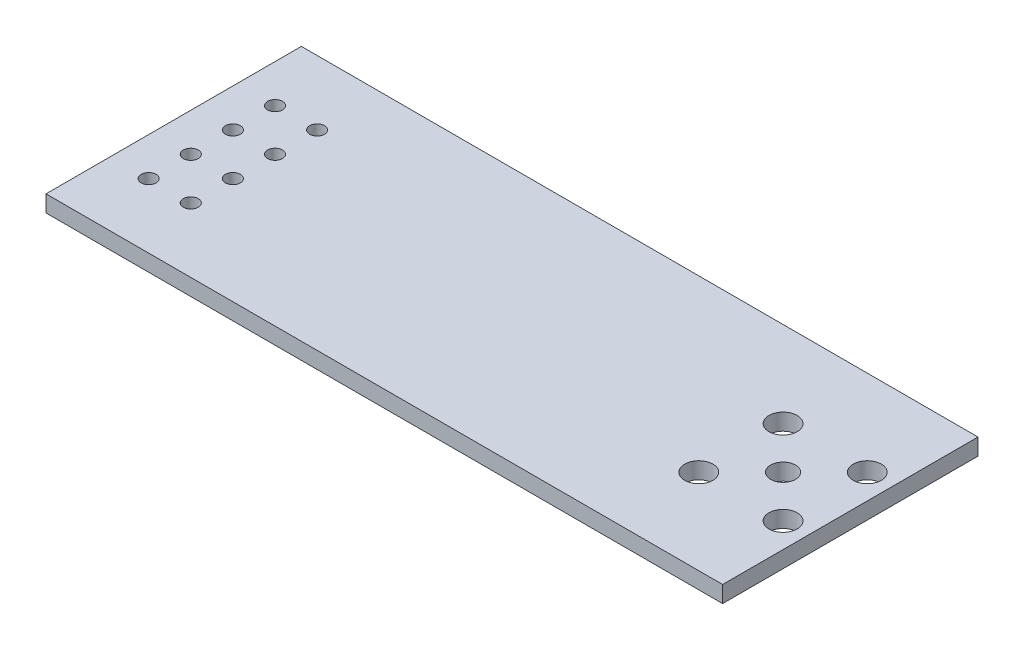
ISO-10303-21;
HEADER;
FILE_DESCRIPTION(('STEP AP214'),'2;1');
FILE_NAME('part.step','',(''),(''),'','','');
FILE_SCHEMA(('AUTOMOTIVE_DESIGN { 1 0 10303 214 1 1 1 1 }'));
ENDSEC;
DATA;
#1=APPLICATION_CONTEXT('core data for automotive mechanical design processes');
#2=APPLICATION_PROTOCOL_DEFINITION('international standard','automotive_design',2000,#1);
#3=PRODUCT_CONTEXT('',#1,'mechanical');
#4=PRODUCT('Part','Part','',(#3));
#5=PRODUCT_RELATED_PRODUCT_CATEGORY('part','',(#4));
#6=PRODUCT_DEFINITION_FORMATION('','',#4);
#7=PRODUCT_DEFINITION_CONTEXT('part definition',#1,'design');
#8=PRODUCT_DEFINITION('design','',#6,#7);
#9=PRODUCT_DEFINITION_SHAPE('','',#8);
#10=(LENGTH_UNIT() NAMED_UNIT(*) SI_UNIT(.MILLI.,.METRE.));
#11=(NAMED_UNIT(*) PLANE_ANGLE_UNIT() SI_UNIT($,.RADIAN.));
#12=(NAMED_UNIT(*) SI_UNIT($,.STERADIAN.) SOLID_ANGLE_UNIT());
#13=UNCERTAINTY_MEASURE_WITH_UNIT(LENGTH_MEASURE(1.E-05),#10,'distance_accuracy_value','');
#14=(GEOMETRIC_REPRESENTATION_CONTEXT(3) GLOBAL_UNCERTAINTY_ASSIGNED_CONTEXT((#13)) GLOBAL_UNIT_ASSIGNED_CONTEXT((#10,
#11,#12)) REPRESENTATION_CONTEXT('',''));
#15=CARTESIAN_POINT('',(0.,0.,0.));
#16=DIRECTION('',(0.,0.,1.));
#17=DIRECTION('',(1.,0.,0.));
#18=AXIS2_PLACEMENT_3D('',#15,#16,#17);
#19=CARTESIAN_POINT('',(0.,1.,0.));
#20=DIRECTION('',(0.,-1.,0.));
#21=DIRECTION('',(0.,0.,-1.));
#22=AXIS2_PLACEMENT_3D('',#19,#20,#21);
#23=PLANE('',#22);
#24=DIRECTION('',(0.,0.,1.));
#25=VECTOR('',#24,1.);
#26=CARTESIAN_POINT('',(0.,1.,0.));
#27=LINE('',#26,#25);
#28=CARTESIAN_POINT('',(0.,1.,-15.4));
#29=VERTEX_POINT('',#28);
#30=CARTESIAN_POINT('',(0.,1.,0.));
#31=VERTEX_POINT('',#30);
#32=EDGE_CURVE('E90',#29,#31,#27,.T.);
#33=ORIENTED_EDGE('',*,*,#32,.T.);
#34=DIRECTION('',(1.,0.,0.));
#35=VECTOR('',#34,1.);
#36=CARTESIAN_POINT('',(0.,1.,0.));
#37=LINE('',#36,#35);
#38=CARTESIAN_POINT('',(40.8,1.,0.));
#39=VERTEX_POINT('',#38);
#40=EDGE_CURVE('E85',#31,#39,#37,.T.);
#41=ORIENTED_EDGE('',*,*,#40,.T.);
#42=DIRECTION('',(0.,0.,-1.));
#43=VECTOR('',#42,1.);
#44=CARTESIAN_POINT('',(40.8,1.,0.));
#45=LINE('',#44,#43);
#46=CARTESIAN_POINT('',(40.8,1.,-15.4));
#47=VERTEX_POINT('',#46);
#48=EDGE_CURVE('E88',#39,#47,#45,.T.);
#49=ORIENTED_EDGE('',*,*,#48,.T.);
#50=DIRECTION('',(-1.,0.,0.));
#51=VECTOR('',#50,1.);
#52=CARTESIAN_POINT('',(0.,1.,-15.4));
#53=LINE('',#52,#51);
#54=EDGE_CURVE('E55',#47,#29,#53,.T.);
#55=ORIENTED_EDGE('',*,*,#54,.T.);
#56=EDGE_LOOP('',(#33,#41,#49,#55));
#57=FACE_BOUND('',#56,.T.);
#58=CARTESIAN_POINT('',(2.29999234116474,1.,-3.89));
#59=DIRECTION('',(0.,1.,0.));
#60=DIRECTION('',(0.,0.,1.));
#61=AXIS2_PLACEMENT_3D('',#58,#59,#60);
#62=CIRCLE('',#61,0.45);
#63=CARTESIAN_POINT('',(2.29999234116474,1.,-3.44));
#64=VERTEX_POINT('',#63);
#65=EDGE_CURVE('E105',#64,#64,#62,.T.);
#66=ORIENTED_EDGE('',*,*,#65,.F.);
#67=EDGE_LOOP('',(#66));
#68=FACE_BOUND('',#67,.T.);
#69=CARTESIAN_POINT('',(2.29999392821584,1.,-6.43000000000198));
#70=DIRECTION('',(0.,1.,0.));
#71=DIRECTION('',(0.,0.,1.));
#72=AXIS2_PLACEMENT_3D('',#69,#70,#71);
#73=CIRCLE('',#72,0.45);
#74=CARTESIAN_POINT('',(2.29999392821584,1.,-5.98000000000198));
#75=VERTEX_POINT('',#74);
#76=EDGE_CURVE('E120',#75,#75,#73,.T.);
#77=ORIENTED_EDGE('',*,*,#76,.F.);
#78=EDGE_LOOP('',(#77));
#79=FACE_BOUND('',#78,.T.);
#80=CARTESIAN_POINT('',(2.29999551526694,1.,-8.97000000000396));
#81=DIRECTION('',(0.,1.,0.));
#82=DIRECTION('',(0.,0.,1.));
#83=AXIS2_PLACEMENT_3D('',#80,#81,#82);
#84=CIRCLE('',#83,0.449999999998743);
#85=CARTESIAN_POINT('',(2.29999551526694,1.,-8.52000000000521));
#86=VERTEX_POINT('',#85);
#87=EDGE_CURVE('E126',#86,#86,#84,.T.);
#88=ORIENTED_EDGE('',*,*,#87,.F.);
#89=EDGE_LOOP('',(#88));
#90=FACE_BOUND('',#89,.T.);
#91=CARTESIAN_POINT('',(2.3,1.,-11.51));
#92=DIRECTION('',(0.,1.,0.));
#93=DIRECTION('',(0.,0.,1.));
#94=AXIS2_PLACEMENT_3D('',#91,#92,#93);
#95=CIRCLE('',#94,0.45);
#96=CARTESIAN_POINT('',(2.3,1.,-11.06));
#97=VERTEX_POINT('',#96);
#98=EDGE_CURVE('E132',#97,#97,#95,.T.);
#99=ORIENTED_EDGE('',*,*,#98,.F.);
#100=EDGE_LOOP('',(#99));
#101=FACE_BOUND('',#100,.T.);
#102=CARTESIAN_POINT('',(4.83999234116474,1.,-3.89));
#103=DIRECTION('',(0.,1.,0.));
#104=DIRECTION('',(0.,0.,1.));
#105=AXIS2_PLACEMENT_3D('',#102,#103,#104);
#106=CIRCLE('',#105,0.45);
#107=CARTESIAN_POINT('',(4.83999234116474,1.,-3.44));
#108=VERTEX_POINT('',#107);
#109=EDGE_CURVE('E138',#108,#108,#106,.T.);
#110=ORIENTED_EDGE('',*,*,#109,.F.);
#111=EDGE_LOOP('',(#110));
#112=FACE_BOUND('',#111,.T.);
#113=CARTESIAN_POINT('',(4.83999234116474,1.,-6.43));
#114=DIRECTION('',(0.,1.,0.));
#115=DIRECTION('',(0.,0.,1.));
#116=AXIS2_PLACEMENT_3D('',#113,#114,#115);
#117=CIRCLE('',#116,0.45);
#118=CARTESIAN_POINT('',(4.83999234116474,1.,-5.98));
#119=VERTEX_POINT('',#118);
#120=EDGE_CURVE('E144',#119,#119,#117,.T.);
#121=ORIENTED_EDGE('',*,*,#120,.F.);
#122=EDGE_LOOP('',(#121));
#123=FACE_BOUND('',#122,.T.);
#124=CARTESIAN_POINT('',(4.83999234116474,1.,-8.97));
#125=DIRECTION('',(0.,1.,0.));
#126=DIRECTION('',(0.,0.,1.));
#127=AXIS2_PLACEMENT_3D('',#124,#125,#126);
#128=CIRCLE('',#127,0.450000000000002);
#129=CARTESIAN_POINT('',(4.83999234116474,1.,-8.52));
#130=VERTEX_POINT('',#129);
#131=EDGE_CURVE('E150',#130,#130,#128,.T.);
#132=ORIENTED_EDGE('',*,*,#131,.F.);
#133=EDGE_LOOP('',(#132));
#134=FACE_BOUND('',#133,.T.);
#135=CARTESIAN_POINT('',(4.83999234116474,1.,-11.51));
#136=DIRECTION('',(0.,1.,0.));
#137=DIRECTION('',(0.,0.,1.));
#138=AXIS2_PLACEMENT_3D('',#135,#136,#137);
#139=CIRCLE('',#138,0.450000000000002);
#140=CARTESIAN_POINT('',(4.83999234116474,1.,-11.06));
#141=VERTEX_POINT('',#140);
#142=EDGE_CURVE('E156',#141,#141,#139,.T.);
#143=ORIENTED_EDGE('',*,*,#142,.F.);
#144=EDGE_LOOP('',(#143));
#145=FACE_BOUND('',#144,.T.);
#146=CARTESIAN_POINT('',(34.22,1.,-10.2243668977098));
#147=DIRECTION('',(0.,1.,0.));
#148=DIRECTION('',(0.,0.,1.));
#149=AXIS2_PLACEMENT_3D('',#146,#147,#148);
#150=CIRCLE('',#149,0.849999999999999);
#151=CARTESIAN_POINT('',(34.22,1.,-9.37436689770982));
#152=VERTEX_POINT('',#151);
#153=EDGE_CURVE('E162',#152,#152,#150,.T.);
#154=ORIENTED_EDGE('',*,*,#153,.F.);
#155=EDGE_LOOP('',(#154));
#156=FACE_BOUND('',#155,.T.);
#157=CARTESIAN_POINT('',(34.22,1.,-5.14436689770982));
#158=DIRECTION('',(0.,1.,0.));
#159=DIRECTION('',(0.,0.,1.));
#160=AXIS2_PLACEMENT_3D('',#157,#158,#159);
#161=CIRCLE('',#160,0.85);
#162=CARTESIAN_POINT('',(34.22,1.,-4.29436689770982));
#163=VERTEX_POINT('',#162);
#164=EDGE_CURVE('E168',#163,#163,#161,.T.);
#165=ORIENTED_EDGE('',*,*,#164,.F.);
#166=EDGE_LOOP('',(#165));
#167=FACE_BOUND('',#166,.T.);
#168=CARTESIAN_POINT('',(39.3,1.,-5.14436689770982));
#169=DIRECTION('',(0.,1.,0.));
#170=DIRECTION('',(0.,0.,1.));
#171=AXIS2_PLACEMENT_3D('',#168,#169,#170);
#172=CIRCLE('',#171,0.85);
#173=CARTESIAN_POINT('',(39.3,1.,-4.29436689770982));
#174=VERTEX_POINT('',#173);
#175=EDGE_CURVE('E174',#174,#174,#172,.T.);
#176=ORIENTED_EDGE('',*,*,#175,.F.);
#177=EDGE_LOOP('',(#176));
#178=FACE_BOUND('',#177,.T.);
#179=CARTESIAN_POINT('',(39.3,1.,-10.2243668977098));
#180=DIRECTION('',(0.,1.,0.));
#181=DIRECTION('',(0.,0.,1.));
#182=AXIS2_PLACEMENT_3D('',#179,#180,#181);
#183=CIRCLE('',#182,0.849999999999999);
#184=CARTESIAN_POINT('',(39.3,1.,-9.37436689770982));
#185=VERTEX_POINT('',#184);
#186=EDGE_CURVE('E180',#185,#185,#183,.T.);
#187=ORIENTED_EDGE('',*,*,#186,.F.);
#188=EDGE_LOOP('',(#187));
#189=FACE_BOUND('',#188,.T.);
#190=CARTESIAN_POINT('',(36.76,1.,-7.68436689770982));
#191=DIRECTION('',(0.,1.,0.));
#192=DIRECTION('',(0.,0.,1.));
#193=AXIS2_PLACEMENT_3D('',#190,#191,#192);
#194=CIRCLE('',#193,0.749999999999999);
#195=CARTESIAN_POINT('',(36.76,1.,-6.93436689770982));
#196=VERTEX_POINT('',#195);
#197=EDGE_CURVE('E186',#196,#196,#194,.T.);
#198=ORIENTED_EDGE('',*,*,#197,.F.);
#199=EDGE_LOOP('',(#198));
#200=FACE_BOUND('',#199,.T.);
#201=ADVANCED_FACE('F38',(#57,#68,#79,#90,#101,#112,#123,#134,#145,#156,#167,#178,#189,#200),
#23,.F.);
#202=CARTESIAN_POINT('',(0.,0.,0.));
#203=DIRECTION('',(0.,-1.,0.));
#204=DIRECTION('',(0.,0.,-1.));
#205=AXIS2_PLACEMENT_3D('',#202,#203,#204);
#206=PLANE('',#205);
#207=CARTESIAN_POINT('',(39.3,0.,-10.2243668977098));
#208=DIRECTION('',(0.,1.,0.));
#209=DIRECTION('',(0.,0.,1.));
#210=AXIS2_PLACEMENT_3D('',#207,#208,#209);
#211=CIRCLE('',#210,0.849999999999999);
#212=CARTESIAN_POINT('',(39.3,0.,-9.37436689770982));
#213=VERTEX_POINT('',#212);
#214=EDGE_CURVE('E183',#213,#213,#211,.T.);
#215=ORIENTED_EDGE('',*,*,#214,.T.);
#216=EDGE_LOOP('',(#215));
#217=FACE_BOUND('',#216,.T.);
#218=CARTESIAN_POINT('',(34.22,0.,-5.14436689770982));
#219=DIRECTION('',(0.,1.,0.));
#220=DIRECTION('',(0.,0.,1.));
#221=AXIS2_PLACEMENT_3D('',#218,#219,#220);
#222=CIRCLE('',#221,0.85);
#223=CARTESIAN_POINT('',(34.22,0.,-4.29436689770982));
#224=VERTEX_POINT('',#223);
#225=EDGE_CURVE('E171',#224,#224,#222,.T.);
#226=ORIENTED_EDGE('',*,*,#225,.T.);
#227=EDGE_LOOP('',(#226));
#228=FACE_BOUND('',#227,.T.);
#229=CARTESIAN_POINT('',(4.83999234116474,0.,-11.51));
#230=DIRECTION('',(0.,1.,0.));
#231=DIRECTION('',(0.,0.,1.));
#232=AXIS2_PLACEMENT_3D('',#229,#230,#231);
#233=CIRCLE('',#232,0.450000000000002);
#234=CARTESIAN_POINT('',(4.83999234116474,0.,-11.06));
#235=VERTEX_POINT('',#234);
#236=EDGE_CURVE('E159',#235,#235,#233,.T.);
#237=ORIENTED_EDGE('',*,*,#236,.T.);
#238=EDGE_LOOP('',(#237));
#239=FACE_BOUND('',#238,.T.);
#240=CARTESIAN_POINT('',(4.83999234116474,0.,-6.43));
#241=DIRECTION('',(0.,1.,0.));
#242=DIRECTION('',(0.,0.,1.));
#243=AXIS2_PLACEMENT_3D('',#240,#241,#242);
#244=CIRCLE('',#243,0.45);
#245=CARTESIAN_POINT('',(4.83999234116474,0.,-5.98));
#246=VERTEX_POINT('',#245);
#247=EDGE_CURVE('E147',#246,#246,#244,.T.);
#248=ORIENTED_EDGE('',*,*,#247,.T.);
#249=EDGE_LOOP('',(#248));
#250=FACE_BOUND('',#249,.T.);
#251=CARTESIAN_POINT('',(2.3,0.,-11.51));
#252=DIRECTION('',(0.,1.,0.));
#253=DIRECTION('',(0.,0.,1.));
#254=AXIS2_PLACEMENT_3D('',#251,#252,#253);
#255=CIRCLE('',#254,0.45);
#256=CARTESIAN_POINT('',(2.3,0.,-11.06));
#257=VERTEX_POINT('',#256);
#258=EDGE_CURVE('E135',#257,#257,#255,.T.);
#259=ORIENTED_EDGE('',*,*,#258,.T.);
#260=EDGE_LOOP('',(#259));
#261=FACE_BOUND('',#260,.T.);
#262=CARTESIAN_POINT('',(2.29999392821584,0.,-6.43000000000198));
#263=DIRECTION('',(0.,1.,0.));
#264=DIRECTION('',(0.,0.,1.));
#265=AXIS2_PLACEMENT_3D('',#262,#263,#264);
#266=CIRCLE('',#265,0.45);
#267=CARTESIAN_POINT('',(2.29999392821584,0.,-5.98000000000198));
#268=VERTEX_POINT('',#267);
#269=EDGE_CURVE('E123',#268,#268,#266,.T.);
#270=ORIENTED_EDGE('',*,*,#269,.T.);
#271=EDGE_LOOP('',(#270));
#272=FACE_BOUND('',#271,.T.);
#273=DIRECTION('',(0.,0.,1.));
#274=VECTOR('',#273,1.);
#275=CARTESIAN_POINT('',(0.,0.,0.));
#276=LINE('',#275,#274);
#277=CARTESIAN_POINT('',(0.,0.,-15.4));
#278=VERTEX_POINT('',#277);
#279=CARTESIAN_POINT('',(0.,0.,0.));
#280=VERTEX_POINT('',#279);
#281=EDGE_CURVE('E102',#278,#280,#276,.T.);
#282=ORIENTED_EDGE('',*,*,#281,.F.);
#283=DIRECTION('',(-1.,0.,0.));
#284=VECTOR('',#283,1.);
#285=CARTESIAN_POINT('',(0.,0.,-15.4));
#286=LINE('',#285,#284);
#287=CARTESIAN_POINT('',(40.8,0.,-15.4));
#288=VERTEX_POINT('',#287);
#289=EDGE_CURVE('E78',#288,#278,#286,.T.);
#290=ORIENTED_EDGE('',*,*,#289,.F.);
#291=DIRECTION('',(0.,0.,-1.));
#292=VECTOR('',#291,1.);
#293=CARTESIAN_POINT('',(40.8,0.,0.));
#294=LINE('',#293,#292);
#295=CARTESIAN_POINT('',(40.8,0.,0.));
#296=VERTEX_POINT('',#295);
#297=EDGE_CURVE('E72',#296,#288,#294,.T.);
#298=ORIENTED_EDGE('',*,*,#297,.F.);
#299=DIRECTION('',(1.,0.,0.));
#300=VECTOR('',#299,1.);
#301=CARTESIAN_POINT('',(0.,0.,0.));
#302=LINE('',#301,#300);
#303=EDGE_CURVE('E94',#280,#296,#302,.T.);
#304=ORIENTED_EDGE('',*,*,#303,.F.);
#305=EDGE_LOOP('',(#282,#290,#298,#304));
#306=FACE_BOUND('',#305,.T.);
#307=CARTESIAN_POINT('',(2.29999234116474,0.,-3.89));
#308=DIRECTION('',(0.,1.,0.));
#309=DIRECTION('',(0.,0.,1.));
#310=AXIS2_PLACEMENT_3D('',#307,#308,#309);
#311=CIRCLE('',#310,0.45);
#312=CARTESIAN_POINT('',(2.29999234116474,0.,-3.44));
#313=VERTEX_POINT('',#312);
#314=EDGE_CURVE('E117',#313,#313,#311,.T.);
#315=ORIENTED_EDGE('',*,*,#314,.T.);
#316=EDGE_LOOP('',(#315));
#317=FACE_BOUND('',#316,.T.);
#318=CARTESIAN_POINT('',(2.29999551526694,0.,-8.97000000000396));
#319=DIRECTION('',(0.,1.,0.));
#320=DIRECTION('',(0.,0.,1.));
#321=AXIS2_PLACEMENT_3D('',#318,#319,#320);
#322=CIRCLE('',#321,0.449999999998743);
#323=CARTESIAN_POINT('',(2.29999551526694,0.,-8.52000000000521));
#324=VERTEX_POINT('',#323);
#325=EDGE_CURVE('E129',#324,#324,#322,.T.);
#326=ORIENTED_EDGE('',*,*,#325,.T.);
#327=EDGE_LOOP('',(#326));
#328=FACE_BOUND('',#327,.T.);
#329=CARTESIAN_POINT('',(4.83999234116474,0.,-3.89));
#330=DIRECTION('',(0.,1.,0.));
#331=DIRECTION('',(0.,0.,1.));
#332=AXIS2_PLACEMENT_3D('',#329,#330,#331);
#333=CIRCLE('',#332,0.45);
#334=CARTESIAN_POINT('',(4.83999234116474,0.,-3.44));
#335=VERTEX_POINT('',#334);
#336=EDGE_CURVE('E141',#335,#335,#333,.T.);
#337=ORIENTED_EDGE('',*,*,#336,.T.);
#338=EDGE_LOOP('',(#337));
#339=FACE_BOUND('',#338,.T.);
#340=CARTESIAN_POINT('',(4.83999234116474,0.,-8.97));
#341=DIRECTION('',(0.,1.,0.));
#342=DIRECTION('',(0.,0.,1.));
#343=AXIS2_PLACEMENT_3D('',#340,#341,#342);
#344=CIRCLE('',#343,0.450000000000002);
#345=CARTESIAN_POINT('',(4.83999234116474,0.,-8.52));
#346=VERTEX_POINT('',#345);
#347=EDGE_CURVE('E153',#346,#346,#344,.T.);
#348=ORIENTED_EDGE('',*,*,#347,.T.);
#349=EDGE_LOOP('',(#348));
#350=FACE_BOUND('',#349,.T.);
#351=CARTESIAN_POINT('',(34.22,0.,-10.2243668977098));
#352=DIRECTION('',(0.,1.,0.));
#353=DIRECTION('',(0.,0.,1.));
#354=AXIS2_PLACEMENT_3D('',#351,#352,#353);
#355=CIRCLE('',#354,0.849999999999999);
#356=CARTESIAN_POINT('',(34.22,0.,-9.37436689770982));
#357=VERTEX_POINT('',#356);
#358=EDGE_CURVE('E165',#357,#357,#355,.T.);
#359=ORIENTED_EDGE('',*,*,#358,.T.);
#360=EDGE_LOOP('',(#359));
#361=FACE_BOUND('',#360,.T.);
#362=CARTESIAN_POINT('',(39.3,0.,-5.14436689770982));
#363=DIRECTION('',(0.,1.,0.));
#364=DIRECTION('',(0.,0.,1.));
#365=AXIS2_PLACEMENT_3D('',#362,#363,#364);
#366=CIRCLE('',#365,0.85);
#367=CARTESIAN_POINT('',(39.3,0.,-4.29436689770982));
#368=VERTEX_POINT('',#367);
#369=EDGE_CURVE('E177',#368,#368,#366,.T.);
#370=ORIENTED_EDGE('',*,*,#369,.T.);
#371=EDGE_LOOP('',(#370));
#372=FACE_BOUND('',#371,.T.);
#373=CARTESIAN_POINT('',(36.76,0.,-7.68436689770982));
#374=DIRECTION('',(0.,1.,0.));
#375=DIRECTION('',(0.,0.,1.));
#376=AXIS2_PLACEMENT_3D('',#373,#374,#375);
#377=CIRCLE('',#376,0.749999999999999);
#378=CARTESIAN_POINT('',(36.76,0.,-6.93436689770982));
#379=VERTEX_POINT('',#378);
#380=EDGE_CURVE('E189',#379,#379,#377,.T.);
#381=ORIENTED_EDGE('',*,*,#380,.T.);
#382=EDGE_LOOP('',(#381));
#383=FACE_BOUND('',#382,.T.);
#384=ADVANCED_FACE('F113',(#217,#228,#239,#250,#261,#272,#306,#317,#328,#339,#350,#361,#372,
#383),#206,.T.);
#385=CARTESIAN_POINT('',(0.,1.,0.));
#386=DIRECTION('',(1.,0.,0.));
#387=DIRECTION('',(0.,0.,-1.));
#388=AXIS2_PLACEMENT_3D('',#385,#386,#387);
#389=PLANE('',#388);
#390=ORIENTED_EDGE('',*,*,#281,.T.);
#391=DIRECTION('',(0.,-1.,0.));
#392=VECTOR('',#391,1.);
#393=CARTESIAN_POINT('',(0.,1.,0.));
#394=LINE('',#393,#392);
#395=EDGE_CURVE('E11',#31,#280,#394,.T.);
#396=ORIENTED_EDGE('',*,*,#395,.F.);
#397=ORIENTED_EDGE('',*,*,#32,.F.);
#398=DIRECTION('',(0.,-1.,0.));
#399=VECTOR('',#398,1.);
#400=CARTESIAN_POINT('',(0.,1.,-15.4));
#401=LINE('',#400,#399);
#402=EDGE_CURVE('E98',#29,#278,#401,.T.);
#403=ORIENTED_EDGE('',*,*,#402,.T.);
#404=EDGE_LOOP('',(#390,#396,#397,#403));
#405=FACE_BOUND('',#404,.T.);
#406=ADVANCED_FACE('F40',(#405),#389,.F.);
#407=CARTESIAN_POINT('',(0.,1.,0.));
#408=DIRECTION('',(0.,0.,-1.));
#409=DIRECTION('',(-1.,0.,0.));
#410=AXIS2_PLACEMENT_3D('',#407,#408,#409);
#411=PLANE('',#410);
#412=ORIENTED_EDGE('',*,*,#303,.T.);
#413=DIRECTION('',(0.,-1.,0.));
#414=VECTOR('',#413,1.);
#415=CARTESIAN_POINT('',(40.8,1.,0.));
#416=LINE('',#415,#414);
#417=EDGE_CURVE('E47',#39,#296,#416,.T.);
#418=ORIENTED_EDGE('',*,*,#417,.F.);
#419=ORIENTED_EDGE('',*,*,#40,.F.);
#420=ORIENTED_EDGE('',*,*,#395,.T.);
#421=EDGE_LOOP('',(#412,#418,#419,#420));
#422=FACE_BOUND('',#421,.T.);
#423=ADVANCED_FACE('F93',(#422),#411,.F.);
#424=CARTESIAN_POINT('',(40.8,1.,0.));
#425=DIRECTION('',(-1.,0.,0.));
#426=DIRECTION('',(0.,0.,1.));
#427=AXIS2_PLACEMENT_3D('',#424,#425,#426);
#428=PLANE('',#427);
#429=ORIENTED_EDGE('',*,*,#297,.T.);
#430=DIRECTION('',(0.,-1.,0.));
#431=VECTOR('',#430,1.);
#432=CARTESIAN_POINT('',(40.8,1.,-15.4));
#433=LINE('',#432,#431);
#434=EDGE_CURVE('E95',#47,#288,#433,.T.);
#435=ORIENTED_EDGE('',*,*,#434,.F.);
#436=ORIENTED_EDGE('',*,*,#48,.F.);
#437=ORIENTED_EDGE('',*,*,#417,.T.);
#438=EDGE_LOOP('',(#429,#435,#436,#437));
#439=FACE_BOUND('',#438,.T.);
#440=ADVANCED_FACE('F96',(#439),#428,.F.);
#441=CARTESIAN_POINT('',(0.,1.,-15.4));
#442=DIRECTION('',(0.,0.,1.));
#443=DIRECTION('',(1.,0.,0.));
#444=AXIS2_PLACEMENT_3D('',#441,#442,#443);
#445=PLANE('',#444);
#446=ORIENTED_EDGE('',*,*,#289,.T.);
#447=ORIENTED_EDGE('',*,*,#402,.F.);
#448=ORIENTED_EDGE('',*,*,#54,.F.);
#449=ORIENTED_EDGE('',*,*,#434,.T.);
#450=EDGE_LOOP('',(#446,#447,#448,#449));
#451=FACE_BOUND('',#450,.T.);
#452=ADVANCED_FACE('F110',(#451),#445,.F.);
#453=CARTESIAN_POINT('',(2.29999234116474,1.,-3.89));
#454=DIRECTION('',(0.,-1.,0.));
#455=DIRECTION('',(0.,0.,-1.));
#456=AXIS2_PLACEMENT_3D('',#453,#454,#455);
#457=CYLINDRICAL_SURFACE('',#456,0.45);
#458=ORIENTED_EDGE('',*,*,#65,.T.);
#459=EDGE_LOOP('',(#458));
#460=FACE_BOUND('',#459,.T.);
#461=ORIENTED_EDGE('',*,*,#314,.F.);
#462=EDGE_LOOP('',(#461));
#463=FACE_BOUND('',#462,.T.);
#464=ADVANCED_FACE('F206',(#460,#463),#457,.F.);
#465=CARTESIAN_POINT('',(2.29999392821584,1.,-6.43000000000198));
#466=DIRECTION('',(0.,-1.,0.));
#467=DIRECTION('',(0.,0.,-1.));
#468=AXIS2_PLACEMENT_3D('',#465,#466,#467);
#469=CYLINDRICAL_SURFACE('',#468,0.45);
#470=ORIENTED_EDGE('',*,*,#76,.T.);
#471=EDGE_LOOP('',(#470));
#472=FACE_BOUND('',#471,.T.);
#473=ORIENTED_EDGE('',*,*,#269,.F.);
#474=EDGE_LOOP('',(#473));
#475=FACE_BOUND('',#474,.T.);
#476=ADVANCED_FACE('F261',(#472,#475),#469,.F.);
#477=CARTESIAN_POINT('',(2.29999551526694,1.,-8.97000000000396));
#478=DIRECTION('',(0.,-1.,0.));
#479=DIRECTION('',(0.,0.,-1.));
#480=AXIS2_PLACEMENT_3D('',#477,#478,#479);
#481=CYLINDRICAL_SURFACE('',#480,0.449999999998743);
#482=ORIENTED_EDGE('',*,*,#87,.T.);
#483=EDGE_LOOP('',(#482));
#484=FACE_BOUND('',#483,.T.);
#485=ORIENTED_EDGE('',*,*,#325,.F.);
#486=EDGE_LOOP('',(#485));
#487=FACE_BOUND('',#486,.T.);
#488=ADVANCED_FACE('F270',(#484,#487),#481,.F.);
#489=CARTESIAN_POINT('',(2.3,1.,-11.51));
#490=DIRECTION('',(0.,-1.,0.));
#491=DIRECTION('',(0.,0.,-1.));
#492=AXIS2_PLACEMENT_3D('',#489,#490,#491);
#493=CYLINDRICAL_SURFACE('',#492,0.45);
#494=ORIENTED_EDGE('',*,*,#98,.T.);
#495=EDGE_LOOP('',(#494));
#496=FACE_BOUND('',#495,.T.);
#497=ORIENTED_EDGE('',*,*,#258,.F.);
#498=EDGE_LOOP('',(#497));
#499=FACE_BOUND('',#498,.T.);
#500=ADVANCED_FACE('F279',(#496,#499),#493,.F.);
#501=CARTESIAN_POINT('',(4.83999234116474,1.,-3.89));
#502=DIRECTION('',(0.,-1.,0.));
#503=DIRECTION('',(0.,0.,-1.));
#504=AXIS2_PLACEMENT_3D('',#501,#502,#503);
#505=CYLINDRICAL_SURFACE('',#504,0.45);
#506=ORIENTED_EDGE('',*,*,#109,.T.);
#507=EDGE_LOOP('',(#506));
#508=FACE_BOUND('',#507,.T.);
#509=ORIENTED_EDGE('',*,*,#336,.F.);
#510=EDGE_LOOP('',(#509));
#511=FACE_BOUND('',#510,.T.);
#512=ADVANCED_FACE('F289',(#508,#511),#505,.F.);
#513=CARTESIAN_POINT('',(4.83999234116474,1.,-6.43));
#514=DIRECTION('',(0.,-1.,0.));
#515=DIRECTION('',(0.,0.,-1.));
#516=AXIS2_PLACEMENT_3D('',#513,#514,#515);
#517=CYLINDRICAL_SURFACE('',#516,0.45);
#518=ORIENTED_EDGE('',*,*,#120,.T.);
#519=EDGE_LOOP('',(#518));
#520=FACE_BOUND('',#519,.T.);
#521=ORIENTED_EDGE('',*,*,#247,.F.);
#522=EDGE_LOOP('',(#521));
#523=FACE_BOUND('',#522,.T.);
#524=ADVANCED_FACE('F299',(#520,#523),#517,.F.);
#525=CARTESIAN_POINT('',(4.83999234116474,1.,-8.97));
#526=DIRECTION('',(0.,-1.,0.));
#527=DIRECTION('',(0.,0.,-1.));
#528=AXIS2_PLACEMENT_3D('',#525,#526,#527);
#529=CYLINDRICAL_SURFACE('',#528,0.450000000000002);
#530=ORIENTED_EDGE('',*,*,#131,.T.);
#531=EDGE_LOOP('',(#530));
#532=FACE_BOUND('',#531,.T.);
#533=ORIENTED_EDGE('',*,*,#347,.F.);
#534=EDGE_LOOP('',(#533));
#535=FACE_BOUND('',#534,.T.);
#536=ADVANCED_FACE('F309',(#532,#535),#529,.F.);
#537=CARTESIAN_POINT('',(4.83999234116474,1.,-11.51));
#538=DIRECTION('',(0.,-1.,0.));
#539=DIRECTION('',(0.,0.,-1.));
#540=AXIS2_PLACEMENT_3D('',#537,#538,#539);
#541=CYLINDRICAL_SURFACE('',#540,0.450000000000002);
#542=ORIENTED_EDGE('',*,*,#142,.T.);
#543=EDGE_LOOP('',(#542));
#544=FACE_BOUND('',#543,.T.);
#545=ORIENTED_EDGE('',*,*,#236,.F.);
#546=EDGE_LOOP('',(#545));
#547=FACE_BOUND('',#546,.T.);
#548=ADVANCED_FACE('F319',(#544,#547),#541,.F.);
#549=CARTESIAN_POINT('',(34.22,1.,-10.2243668977098));
#550=DIRECTION('',(0.,-1.,0.));
#551=DIRECTION('',(0.,0.,-1.));
#552=AXIS2_PLACEMENT_3D('',#549,#550,#551);
#553=CYLINDRICAL_SURFACE('',#552,0.849999999999999);
#554=ORIENTED_EDGE('',*,*,#153,.T.);
#555=EDGE_LOOP('',(#554));
#556=FACE_BOUND('',#555,.T.);
#557=ORIENTED_EDGE('',*,*,#358,.F.);
#558=EDGE_LOOP('',(#557));
#559=FACE_BOUND('',#558,.T.);
#560=ADVANCED_FACE('F329',(#556,#559),#553,.F.);
#561=CARTESIAN_POINT('',(34.22,1.,-5.14436689770982));
#562=DIRECTION('',(0.,-1.,0.));
#563=DIRECTION('',(0.,0.,-1.));
#564=AXIS2_PLACEMENT_3D('',#561,#562,#563);
#565=CYLINDRICAL_SURFACE('',#564,0.85);
#566=ORIENTED_EDGE('',*,*,#164,.T.);
#567=EDGE_LOOP('',(#566));
#568=FACE_BOUND('',#567,.T.);
#569=ORIENTED_EDGE('',*,*,#225,.F.);
#570=EDGE_LOOP('',(#569));
#571=FACE_BOUND('',#570,.T.);
#572=ADVANCED_FACE('F339',(#568,#571),#565,.F.);
#573=CARTESIAN_POINT('',(39.3,1.,-5.14436689770982));
#574=DIRECTION('',(0.,-1.,0.));
#575=DIRECTION('',(0.,0.,-1.));
#576=AXIS2_PLACEMENT_3D('',#573,#574,#575);
#577=CYLINDRICAL_SURFACE('',#576,0.85);
#578=ORIENTED_EDGE('',*,*,#175,.T.);
#579=EDGE_LOOP('',(#578));
#580=FACE_BOUND('',#579,.T.);
#581=ORIENTED_EDGE('',*,*,#369,.F.);
#582=EDGE_LOOP('',(#581));
#583=FACE_BOUND('',#582,.T.);
#584=ADVANCED_FACE('F349',(#580,#583),#577,.F.);
#585=CARTESIAN_POINT('',(39.3,1.,-10.2243668977098));
#586=DIRECTION('',(0.,-1.,0.));
#587=DIRECTION('',(0.,0.,-1.));
#588=AXIS2_PLACEMENT_3D('',#585,#586,#587);
#589=CYLINDRICAL_SURFACE('',#588,0.849999999999999);
#590=ORIENTED_EDGE('',*,*,#186,.T.);
#591=EDGE_LOOP('',(#590));
#592=FACE_BOUND('',#591,.T.);
#593=ORIENTED_EDGE('',*,*,#214,.F.);
#594=EDGE_LOOP('',(#593));
#595=FACE_BOUND('',#594,.T.);
#596=ADVANCED_FACE('F359',(#592,#595),#589,.F.);
#597=CARTESIAN_POINT('',(36.76,1.,-7.68436689770982));
#598=DIRECTION('',(0.,-1.,0.));
#599=DIRECTION('',(0.,0.,-1.));
#600=AXIS2_PLACEMENT_3D('',#597,#598,#599);
#601=CYLINDRICAL_SURFACE('',#600,0.749999999999999);
#602=ORIENTED_EDGE('',*,*,#197,.T.);
#603=EDGE_LOOP('',(#602));
#604=FACE_BOUND('',#603,.T.);
#605=ORIENTED_EDGE('',*,*,#380,.F.);
#606=EDGE_LOOP('',(#605));
#607=FACE_BOUND('',#606,.T.);
#608=ADVANCED_FACE('F195',(#604,#607),#601,.F.);
#609=CLOSED_SHELL('',(#201,#384,#406,#423,#440,#452,#464,#476,#488,#500,#512,#524,#536,#548,
#560,#572,#584,#596,#608));
#610=MANIFOLD_SOLID_BREP('B2',#609);
#611=ADVANCED_BREP_SHAPE_REPRESENTATION('',(#18,#610),#14);
#612=SHAPE_DEFINITION_REPRESENTATION(#9,#611);
ENDSEC;
END-ISO-10303-21;
